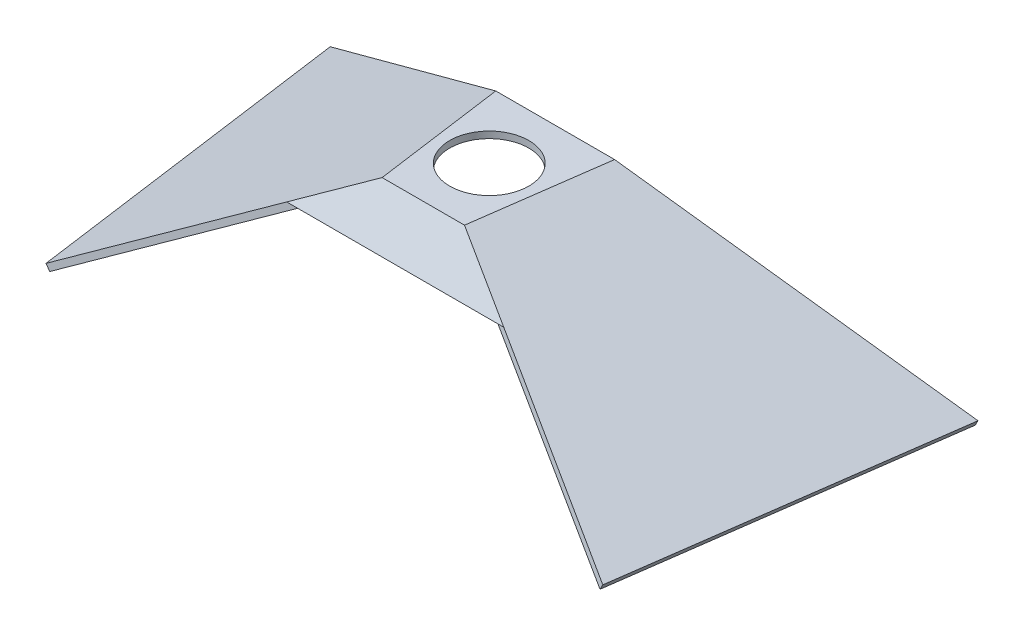
ISO-10303-21;
HEADER;
FILE_DESCRIPTION(('STEP AP214'),'2;1');
FILE_NAME('part.step','',(''),(''),'','','');
FILE_SCHEMA(('AUTOMOTIVE_DESIGN { 1 0 10303 214 1 1 1 1 }'));
ENDSEC;
DATA;
#1=APPLICATION_CONTEXT('core data for automotive mechanical design processes');
#2=APPLICATION_PROTOCOL_DEFINITION('international standard','automotive_design',2000,#1);
#3=PRODUCT_CONTEXT('',#1,'mechanical');
#4=PRODUCT('Part','Part','',(#3));
#5=PRODUCT_RELATED_PRODUCT_CATEGORY('part','',(#4));
#6=PRODUCT_DEFINITION_FORMATION('','',#4);
#7=PRODUCT_DEFINITION_CONTEXT('part definition',#1,'design');
#8=PRODUCT_DEFINITION('design','',#6,#7);
#9=PRODUCT_DEFINITION_SHAPE('','',#8);
#10=(LENGTH_UNIT() NAMED_UNIT(*) SI_UNIT(.MILLI.,.METRE.));
#11=(NAMED_UNIT(*) PLANE_ANGLE_UNIT() SI_UNIT($,.RADIAN.));
#12=(NAMED_UNIT(*) SI_UNIT($,.STERADIAN.) SOLID_ANGLE_UNIT());
#13=UNCERTAINTY_MEASURE_WITH_UNIT(LENGTH_MEASURE(1.E-05),#10,'distance_accuracy_value','');
#14=(GEOMETRIC_REPRESENTATION_CONTEXT(3) GLOBAL_UNCERTAINTY_ASSIGNED_CONTEXT((#13)) GLOBAL_UNIT_ASSIGNED_CONTEXT((#10,
#11,#12)) REPRESENTATION_CONTEXT('',''));
#15=CARTESIAN_POINT('',(0.,0.,0.));
#16=DIRECTION('',(0.,0.,1.));
#17=DIRECTION('',(1.,0.,0.));
#18=AXIS2_PLACEMENT_3D('',#15,#16,#17);
#19=CARTESIAN_POINT('',(-76.614934206943,91.7763117493343,413.028432925909));
#20=DIRECTION('',(0.55007039564233,-0.687480055635322,-0.474124174601491));
#21=DIRECTION('',(0.780820965569463,0.624754847702018,0.));
#22=AXIS2_PLACEMENT_3D('',#19,#20,#21);
#23=PLANE('',#22);
#24=DIRECTION('',(-0.835118290925238,-0.452824984693612,-0.312293088939443));
#25=VECTOR('',#24,1.);
#26=CARTESIAN_POINT('',(-76.6149342168398,94.6603951524479,408.846511964929));
#27=LINE('',#26,#25);
#28=CARTESIAN_POINT('',(-38.0525888196996,115.57,423.266928918652));
#29=VERTEX_POINT('',#28);
#30=CARTESIAN_POINT('',(-76.6149342168398,94.6603951524479,408.846511964929));
#31=VERTEX_POINT('',#30);
#32=EDGE_CURVE('E111',#29,#31,#27,.T.);
#33=ORIENTED_EDGE('',*,*,#32,.T.);
#34=DIRECTION('',(-1.94817627023507E-09,0.567732953368821,-0.823212787594505));
#35=VECTOR('',#34,1.);
#36=CARTESIAN_POINT('',(-76.614934206943,91.7763117493343,413.028432925909));
#37=LINE('',#36,#35);
#38=CARTESIAN_POINT('',(-76.614934206943,91.7763117493343,413.028432925909));
#39=VERTEX_POINT('',#38);
#40=EDGE_CURVE('E12',#39,#31,#37,.T.);
#41=ORIENTED_EDGE('',*,*,#40,.F.);
#42=DIRECTION('',(-0.835118290925238,-0.452824984693612,-0.312293088939443));
#43=VECTOR('',#42,1.);
#44=CARTESIAN_POINT('',(-76.614934206943,91.7763117493343,413.028432925909));
#45=LINE('',#44,#43);
#46=CARTESIAN_POINT('',(-38.0525888098029,112.685916596886,427.448849879632));
#47=VERTEX_POINT('',#46);
#48=EDGE_CURVE('E99',#47,#39,#45,.T.);
#49=ORIENTED_EDGE('',*,*,#48,.F.);
#50=DIRECTION('',(-1.94817627023507E-09,0.567732953368821,-0.823212787594505));
#51=VECTOR('',#50,1.);
#52=CARTESIAN_POINT('',(-38.0525888098029,112.685916596886,427.448849879632));
#53=LINE('',#52,#51);
#54=EDGE_CURVE('E107',#47,#29,#53,.T.);
#55=ORIENTED_EDGE('',*,*,#54,.T.);
#56=EDGE_LOOP('',(#33,#41,#49,#55));
#57=FACE_BOUND('',#56,.T.);
#58=ADVANCED_FACE('F48',(#57),#23,.F.);
#59=CARTESIAN_POINT('',(92.0513793433983,91.7763119358867,413.028432655408));
#60=DIRECTION('',(0.,0.823212787594505,0.567732953368821));
#61=DIRECTION('',(0.,-0.567732953368821,0.823212787594505));
#62=AXIS2_PLACEMENT_3D('',#59,#60,#61);
#63=PLANE('',#62);
#64=DIRECTION('',(1.,1.10604379270031E-09,-1.60376363106273E-09));
#65=VECTOR('',#64,1.);
#66=CARTESIAN_POINT('',(92.0513793335016,94.6603953390003,408.846511694428));
#67=LINE('',#66,#65);
#68=CARTESIAN_POINT('',(92.0513793335016,94.6603953390003,408.846511694428));
#69=VERTEX_POINT('',#68);
#70=EDGE_CURVE('E103',#31,#69,#67,.T.);
#71=ORIENTED_EDGE('',*,*,#70,.T.);
#72=DIRECTION('',(-1.94817627023507E-09,0.567732953368821,-0.823212787594505));
#73=VECTOR('',#72,1.);
#74=CARTESIAN_POINT('',(92.0513793433983,91.7763119358867,413.028432655408));
#75=LINE('',#74,#73);
#76=CARTESIAN_POINT('',(92.0513793433983,91.7763119358867,413.028432655408));
#77=VERTEX_POINT('',#76);
#78=EDGE_CURVE('E56',#77,#69,#75,.T.);
#79=ORIENTED_EDGE('',*,*,#78,.F.);
#80=DIRECTION('',(1.,1.10604379270031E-09,-1.60376363106273E-09));
#81=VECTOR('',#80,1.);
#82=CARTESIAN_POINT('',(92.0513793433983,91.7763119358867,413.028432655408));
#83=LINE('',#82,#81);
#84=EDGE_CURVE('E94',#39,#77,#83,.T.);
#85=ORIENTED_EDGE('',*,*,#84,.F.);
#86=ORIENTED_EDGE('',*,*,#40,.T.);
#87=EDGE_LOOP('',(#71,#79,#85,#86));
#88=FACE_BOUND('',#87,.T.);
#89=ADVANCED_FACE('F102',(#88),#63,.F.);
#90=CARTESIAN_POINT('',(53.4890343585591,112.685916596886,427.448849662994));
#91=DIRECTION('',(-0.55007039788641,-0.687480055635322,-0.474124171997949));
#92=DIRECTION('',(0.78082096432612,-0.624754849255953,0.));
#93=AXIS2_PLACEMENT_3D('',#90,#91,#92);
#94=PLANE('',#93);
#95=DIRECTION('',(-0.835118289447122,0.452824984693614,0.312293092892146));
#96=VECTOR('',#95,1.);
#97=CARTESIAN_POINT('',(53.4890343486624,115.57,423.266928702014));
#98=LINE('',#97,#96);
#99=CARTESIAN_POINT('',(53.4890343486624,115.57,423.266928702014));
#100=VERTEX_POINT('',#99);
#101=EDGE_CURVE('E81',#69,#100,#98,.T.);
#102=ORIENTED_EDGE('',*,*,#101,.T.);
#103=DIRECTION('',(-1.94817627023507E-09,0.567732953368821,-0.823212787594505));
#104=VECTOR('',#103,1.);
#105=CARTESIAN_POINT('',(53.4890343585591,112.685916596886,427.448849662994));
#106=LINE('',#105,#104);
#107=CARTESIAN_POINT('',(53.4890343585591,112.685916596886,427.448849662994));
#108=VERTEX_POINT('',#107);
#109=EDGE_CURVE('E104',#108,#100,#106,.T.);
#110=ORIENTED_EDGE('',*,*,#109,.F.);
#111=DIRECTION('',(-0.835118289447122,0.452824984693614,0.312293092892146));
#112=VECTOR('',#111,1.);
#113=CARTESIAN_POINT('',(53.4890343585591,112.685916596886,427.448849662994));
#114=LINE('',#113,#112);
#115=EDGE_CURVE('E97',#77,#108,#114,.T.);
#116=ORIENTED_EDGE('',*,*,#115,.F.);
#117=ORIENTED_EDGE('',*,*,#78,.T.);
#118=EDGE_LOOP('',(#102,#110,#116,#117));
#119=FACE_BOUND('',#118,.T.);
#120=ADVANCED_FACE('F105',(#119),#94,.F.);
#121=CARTESIAN_POINT('',(-38.0525888098029,112.685916596886,427.448849879632));
#122=DIRECTION('',(-1.34357008316609E-09,-0.823212787594505,-0.567732953368821));
#123=DIRECTION('',(0.,0.567732953368821,-0.823212787594505));
#124=AXIS2_PLACEMENT_3D('',#121,#122,#123);
#125=PLANE('',#124);
#126=DIRECTION('',(-1.,0.,2.36655292808633E-09));
#127=VECTOR('',#126,1.);
#128=CARTESIAN_POINT('',(-38.0525888196996,115.57,423.266928918652));
#129=LINE('',#128,#127);
#130=EDGE_CURVE('E87',#100,#29,#129,.T.);
#131=ORIENTED_EDGE('',*,*,#130,.T.);
#132=ORIENTED_EDGE('',*,*,#54,.F.);
#133=DIRECTION('',(-1.,0.,2.36655292808633E-09));
#134=VECTOR('',#133,1.);
#135=CARTESIAN_POINT('',(-38.0525888098029,112.685916596886,427.448849879632));
#136=LINE('',#135,#134);
#137=EDGE_CURVE('E64',#108,#47,#136,.T.);
#138=ORIENTED_EDGE('',*,*,#137,.F.);
#139=ORIENTED_EDGE('',*,*,#109,.T.);
#140=EDGE_LOOP('',(#131,#132,#138,#139));
#141=FACE_BOUND('',#140,.T.);
#142=ADVANCED_FACE('F118',(#141),#125,.F.);
#143=CARTESIAN_POINT('',(5.60891193099527E-07,-163.453639055823,237.007778130851));
#144=DIRECTION('',(-1.948175726451E-09,0.56773295336882,-0.823212787594506));
#145=DIRECTION('',(0.,0.823212787594506,0.56773295336882));
#146=AXIS2_PLACEMENT_3D('',#143,#144,#145);
#147=PLANE('',#146);
#148=ORIENTED_EDGE('',*,*,#48,.T.);
#149=ORIENTED_EDGE('',*,*,#84,.T.);
#150=ORIENTED_EDGE('',*,*,#115,.T.);
#151=ORIENTED_EDGE('',*,*,#137,.T.);
#152=EDGE_LOOP('',(#148,#149,#150,#151));
#153=FACE_BOUND('',#152,.T.);
#154=ADVANCED_FACE('F95',(#153),#147,.F.);
#155=CARTESIAN_POINT('',(5.50994457646733E-07,-160.569555652709,232.82585716987));
#156=DIRECTION('',(-1.948175726451E-09,0.56773295336882,-0.823212787594506));
#157=DIRECTION('',(0.,0.823212787594506,0.56773295336882));
#158=AXIS2_PLACEMENT_3D('',#155,#156,#157);
#159=PLANE('',#158);
#160=ORIENTED_EDGE('',*,*,#32,.F.);
#161=ORIENTED_EDGE('',*,*,#130,.F.);
#162=ORIENTED_EDGE('',*,*,#101,.F.);
#163=ORIENTED_EDGE('',*,*,#70,.F.);
#164=EDGE_LOOP('',(#160,#161,#162,#163));
#165=FACE_BOUND('',#164,.T.);
#166=ADVANCED_FACE('F121',(#165),#159,.T.);
#167=CLOSED_SHELL('',(#58,#89,#120,#142,#154,#166));
#168=MANIFOLD_SOLID_BREP('B2',#167);
#169=CARTESIAN_POINT('',(-24.0317770052481,112.685916573425,520.68500790749));
#170=DIRECTION('',(-0.59196428788115,0.663480028861955,-0.457572434893867));
#171=DIRECTION('',(-0.746177081818555,-0.665747521639206,0.));
#172=AXIS2_PLACEMENT_3D('',#169,#170,#171);
#173=PLANE('',#172);
#174=DIRECTION('',(-0.805964193915191,-0.487312568806148,0.336077637474126));
#175=VECTOR('',#174,1.);
#176=CARTESIAN_POINT('',(-24.0317769953513,115.57,524.86692885229));
#177=LINE('',#176,#175);
#178=CARTESIAN_POINT('',(-24.0317769953513,115.57,524.86692885229));
#179=VERTEX_POINT('',#178);
#180=CARTESIAN_POINT('',(-75.9052369604463,84.2055929713754,546.497554634795));
#181=VERTEX_POINT('',#180);
#182=EDGE_CURVE('E246',#179,#181,#177,.T.);
#183=ORIENTED_EDGE('',*,*,#182,.F.);
#184=DIRECTION('',(1.94817619940944E-09,0.567732957987197,0.823212784409419));
#185=VECTOR('',#184,1.);
#186=CARTESIAN_POINT('',(-24.0317770052481,112.685916573425,520.68500790749));
#187=LINE('',#186,#185);
#188=CARTESIAN_POINT('',(-24.0317770052481,112.685916573425,520.68500790749));
#189=VERTEX_POINT('',#188);
#190=EDGE_CURVE('E46',#189,#179,#187,.T.);
#191=ORIENTED_EDGE('',*,*,#190,.F.);
#192=DIRECTION('',(-0.805964193915191,-0.487312568806148,0.336077637474126));
#193=VECTOR('',#192,1.);
#194=CARTESIAN_POINT('',(-24.0317770052481,112.685916573425,520.68500790749));
#195=LINE('',#194,#193);
#196=CARTESIAN_POINT('',(-75.905236970343,81.3215095448004,542.315633689995));
#197=VERTEX_POINT('',#196);
#198=EDGE_CURVE('E240',#189,#197,#195,.T.);
#199=ORIENTED_EDGE('',*,*,#198,.T.);
#200=DIRECTION('',(1.94817619940944E-09,0.567732957987197,0.823212784409419));
#201=VECTOR('',#200,1.);
#202=CARTESIAN_POINT('',(-75.905236970343,81.3215095448004,542.315633689995));
#203=LINE('',#202,#201);
#204=EDGE_CURVE('E185',#197,#181,#203,.T.);
#205=ORIENTED_EDGE('',*,*,#204,.T.);
#206=EDGE_LOOP('',(#183,#191,#199,#205));
#207=FACE_BOUND('',#206,.T.);
#208=ADVANCED_FACE('F182',(#207),#173,.T.);
#209=CARTESIAN_POINT('',(39.4682229953008,112.685916573425,520.685007757214));
#210=DIRECTION('',(-1.34357021875109E-09,0.823212784409419,-0.567732957987197));
#211=DIRECTION('',(0.,0.567732957987197,0.823212784409419));
#212=AXIS2_PLACEMENT_3D('',#209,#210,#211);
#213=PLANE('',#212);
#214=DIRECTION('',(-1.,0.,2.36655314765324E-09));
#215=VECTOR('',#214,1.);
#216=CARTESIAN_POINT('',(39.4682230051976,115.57,524.866928702014));
#217=LINE('',#216,#215);
#218=CARTESIAN_POINT('',(39.4682230051976,115.57,524.866928702014));
#219=VERTEX_POINT('',#218);
#220=EDGE_CURVE('E242',#219,#179,#217,.T.);
#221=ORIENTED_EDGE('',*,*,#220,.F.);
#222=DIRECTION('',(1.94817619940944E-09,0.567732957987197,0.823212784409419));
#223=VECTOR('',#222,1.);
#224=CARTESIAN_POINT('',(39.4682229953008,112.685916573425,520.685007757214));
#225=LINE('',#224,#223);
#226=CARTESIAN_POINT('',(39.4682229953008,112.685916573425,520.685007757214));
#227=VERTEX_POINT('',#226);
#228=EDGE_CURVE('E191',#227,#219,#225,.T.);
#229=ORIENTED_EDGE('',*,*,#228,.F.);
#230=DIRECTION('',(-1.,0.,2.36655314765324E-09));
#231=VECTOR('',#230,1.);
#232=CARTESIAN_POINT('',(39.4682229953008,112.685916573425,520.685007757214));
#233=LINE('',#232,#231);
#234=EDGE_CURVE('E237',#227,#189,#233,.T.);
#235=ORIENTED_EDGE('',*,*,#234,.T.);
#236=ORIENTED_EDGE('',*,*,#190,.T.);
#237=EDGE_LOOP('',(#221,#229,#235,#236));
#238=FACE_BOUND('',#237,.T.);
#239=ADVANCED_FACE('F256',(#238),#213,.T.);
#240=CARTESIAN_POINT('',(91.3416833687175,81.321509359818,542.31563342177));
#241=DIRECTION('',(0.591964285715411,0.663480028861956,-0.457572437695696));
#242=DIRECTION('',(-0.746177083028517,0.665747520283068,0.));
#243=AXIS2_PLACEMENT_3D('',#240,#241,#242);
#244=PLANE('',#243);
#245=DIRECTION('',(-0.805964195505882,0.487312568806148,-0.336077633659413));
#246=VECTOR('',#245,1.);
#247=CARTESIAN_POINT('',(91.3416833786143,84.205592786393,546.49755436657));
#248=LINE('',#247,#246);
#249=CARTESIAN_POINT('',(91.3416833786143,84.205592786393,546.49755436657));
#250=VERTEX_POINT('',#249);
#251=EDGE_CURVE('E232',#250,#219,#248,.T.);
#252=ORIENTED_EDGE('',*,*,#251,.F.);
#253=DIRECTION('',(1.94817619940944E-09,0.567732957987197,0.823212784409419));
#254=VECTOR('',#253,1.);
#255=CARTESIAN_POINT('',(91.3416833687175,81.321509359818,542.31563342177));
#256=LINE('',#255,#254);
#257=CARTESIAN_POINT('',(91.3416833687175,81.321509359818,542.31563342177));
#258=VERTEX_POINT('',#257);
#259=EDGE_CURVE('E227',#258,#250,#256,.T.);
#260=ORIENTED_EDGE('',*,*,#259,.F.);
#261=DIRECTION('',(-0.805964195505882,0.487312568806148,-0.336077633659413));
#262=VECTOR('',#261,1.);
#263=CARTESIAN_POINT('',(91.3416833687175,81.321509359818,542.31563342177));
#264=LINE('',#263,#262);
#265=EDGE_CURVE('E230',#258,#227,#264,.T.);
#266=ORIENTED_EDGE('',*,*,#265,.T.);
#267=ORIENTED_EDGE('',*,*,#228,.T.);
#268=EDGE_LOOP('',(#252,#260,#266,#267));
#269=FACE_BOUND('',#268,.T.);
#270=ADVANCED_FACE('F229',(#269),#244,.T.);
#271=CARTESIAN_POINT('',(-75.905236970343,81.3215095448004,542.315633689995));
#272=DIRECTION('',(0.,-0.823212784409419,0.567732957987197));
#273=DIRECTION('',(0.,-0.567732957987197,-0.823212784409419));
#274=AXIS2_PLACEMENT_3D('',#271,#272,#273);
#275=PLANE('',#274);
#276=DIRECTION('',(1.,-1.10604379379311E-09,-1.60376378312466E-09));
#277=VECTOR('',#276,1.);
#278=CARTESIAN_POINT('',(-75.9052369604463,84.2055929713754,546.497554634795));
#279=LINE('',#278,#277);
#280=EDGE_CURVE('E249',#181,#250,#279,.T.);
#281=ORIENTED_EDGE('',*,*,#280,.F.);
#282=ORIENTED_EDGE('',*,*,#204,.F.);
#283=DIRECTION('',(1.,-1.10604379379311E-09,-1.60376378312466E-09));
#284=VECTOR('',#283,1.);
#285=CARTESIAN_POINT('',(-75.905236970343,81.3215095448004,542.315633689995));
#286=LINE('',#285,#284);
#287=EDGE_CURVE('E236',#197,#258,#286,.T.);
#288=ORIENTED_EDGE('',*,*,#287,.T.);
#289=ORIENTED_EDGE('',*,*,#259,.T.);
#290=EDGE_LOOP('',(#281,#282,#288,#289));
#291=FACE_BOUND('',#290,.T.);
#292=ADVANCED_FACE('F239',(#291),#275,.T.);
#293=CARTESIAN_POINT('',(9.59691144080762E-07,279.670968685341,405.522902292263));
#294=DIRECTION('',(-1.94817608305874E-09,-0.567732957987197,-0.823212784409418));
#295=DIRECTION('',(0.,0.823212784409419,-0.567732957987197));
#296=AXIS2_PLACEMENT_3D('',#293,#294,#295);
#297=PLANE('',#296);
#298=ORIENTED_EDGE('',*,*,#198,.F.);
#299=ORIENTED_EDGE('',*,*,#234,.F.);
#300=ORIENTED_EDGE('',*,*,#265,.F.);
#301=ORIENTED_EDGE('',*,*,#287,.F.);
#302=EDGE_LOOP('',(#298,#299,#300,#301));
#303=FACE_BOUND('',#302,.T.);
#304=ADVANCED_FACE('F235',(#303),#297,.T.);
#305=CARTESIAN_POINT('',(9.69587879173762E-07,282.555052111916,409.704823237062));
#306=DIRECTION('',(-1.94817608305874E-09,-0.567732957987197,-0.823212784409418));
#307=DIRECTION('',(0.,0.823212784409419,-0.567732957987197));
#308=AXIS2_PLACEMENT_3D('',#305,#306,#307);
#309=PLANE('',#308);
#310=ORIENTED_EDGE('',*,*,#182,.T.);
#311=ORIENTED_EDGE('',*,*,#280,.T.);
#312=ORIENTED_EDGE('',*,*,#251,.T.);
#313=ORIENTED_EDGE('',*,*,#220,.T.);
#314=EDGE_LOOP('',(#310,#311,#312,#313));
#315=FACE_BOUND('',#314,.T.);
#316=ADVANCED_FACE('F255',(#315),#309,.F.);
#317=CLOSED_SHELL('',(#208,#239,#270,#292,#304,#316));
#318=MANIFOLD_SOLID_BREP('B6',#317);
#319=CARTESIAN_POINT('',(-35.5370849512563,111.1702120246,422.919789091822));
#320=DIRECTION('',(0.857968930698351,0.499870781690815,-0.118399812365316));
#321=DIRECTION('',(0.503411778049508,-0.864046631682013,-2.38270078884459E-09));
#322=AXIS2_PLACEMENT_3D('',#319,#320,#321);
#323=PLANE('',#322);
#324=DIRECTION('',(0.13670455262361,0.,0.990611864098133));
#325=VECTOR('',#324,1.);
#326=CARTESIAN_POINT('',(-38.0525888196996,115.57,423.266928918652));
#327=LINE('',#326,#325);
#328=CARTESIAN_POINT('',(-38.0525888196996,115.57,423.266928918652));
#329=VERTEX_POINT('',#328);
#330=CARTESIAN_POINT('',(-24.0317769953513,115.57,524.86692885229));
#331=VERTEX_POINT('',#330);
#332=EDGE_CURVE('E380',#329,#331,#327,.T.);
#333=ORIENTED_EDGE('',*,*,#332,.T.);
#334=DIRECTION('',(-0.495177926858929,0.866099995157495,0.0683346115806571));
#335=VECTOR('',#334,1.);
#336=CARTESIAN_POINT('',(-21.516273126908,111.1702120246,524.51978902546));
#337=LINE('',#336,#335);
#338=CARTESIAN_POINT('',(-21.516273126908,111.1702120246,524.51978902546));
#339=VERTEX_POINT('',#338);
#340=EDGE_CURVE('E319',#339,#331,#337,.T.);
#341=ORIENTED_EDGE('',*,*,#340,.F.);
#342=DIRECTION('',(0.13670455262361,0.,0.990611864098133));
#343=VECTOR('',#342,1.);
#344=CARTESIAN_POINT('',(-35.5370849512563,111.1702120246,422.919789091822));
#345=LINE('',#344,#343);
#346=CARTESIAN_POINT('',(-35.5370849512563,111.1702120246,422.919789091822));
#347=VERTEX_POINT('',#346);
#348=EDGE_CURVE('E369',#347,#339,#345,.T.);
#349=ORIENTED_EDGE('',*,*,#348,.F.);
#350=DIRECTION('',(-0.495177926858929,0.866099995157495,0.0683346115806571));
#351=VECTOR('',#350,1.);
#352=CARTESIAN_POINT('',(-35.5370849512563,111.1702120246,422.919789091822));
#353=LINE('',#352,#351);
#354=EDGE_CURVE('E180',#347,#329,#353,.T.);
#355=ORIENTED_EDGE('',*,*,#354,.T.);
#356=EDGE_LOOP('',(#333,#341,#349,#355));
#357=FACE_BOUND('',#356,.T.);
#358=ADVANCED_FACE('F316',(#357),#323,.T.);
#359=CARTESIAN_POINT('',(-35.5370849512563,111.1702120246,422.919789091822));
#360=DIRECTION('',(-0.239533423375116,-0.211708128387683,0.947524884876794));
#361=DIRECTION('',(-0.969500617123409,0.,-0.245088868366824));
#362=AXIS2_PLACEMENT_3D('',#359,#360,#361);
#363=PLANE('',#362);
#364=DIRECTION('',(-0.835118290925238,-0.452824984693613,-0.312293088939444));
#365=VECTOR('',#364,1.);
#366=CARTESIAN_POINT('',(-38.0525888196996,115.57,423.266928918652));
#367=LINE('',#366,#365);
#368=CARTESIAN_POINT('',(-241.822749661779,5.07999999999997,347.066929883117));
#369=VERTEX_POINT('',#368);
#370=EDGE_CURVE('E357',#329,#369,#367,.T.);
#371=ORIENTED_EDGE('',*,*,#370,.F.);
#372=ORIENTED_EDGE('',*,*,#354,.F.);
#373=DIRECTION('',(-0.835118290925238,-0.452824984693613,-0.312293088939444));
#374=VECTOR('',#373,1.);
#375=CARTESIAN_POINT('',(-35.5370849512563,111.1702120246,422.919789091822));
#376=LINE('',#375,#374);
#377=CARTESIAN_POINT('',(-239.307245793336,0.680212024599896,346.719790056288));
#378=VERTEX_POINT('',#377);
#379=EDGE_CURVE('E334',#347,#378,#376,.T.);
#380=ORIENTED_EDGE('',*,*,#379,.T.);
#381=DIRECTION('',(-0.495177926858929,0.866099995157495,0.0683346115806571));
#382=VECTOR('',#381,1.);
#383=CARTESIAN_POINT('',(-239.307245793336,0.680212024599896,346.719790056288));
#384=LINE('',#383,#382);
#385=EDGE_CURVE('E325',#378,#369,#384,.T.);
#386=ORIENTED_EDGE('',*,*,#385,.T.);
#387=EDGE_LOOP('',(#371,#372,#380,#386));
#388=FACE_BOUND('',#387,.T.);
#389=ADVANCED_FACE('F386',(#388),#363,.F.);
#390=CARTESIAN_POINT('',(-204.255216232465,0.680212024599896,600.719789890383));
#391=DIRECTION('',(-0.857968930698351,-0.499870781690815,0.118399812365317));
#392=DIRECTION('',(-0.503411778049508,0.864046631682013,2.38270078884459E-09));
#393=AXIS2_PLACEMENT_3D('',#390,#391,#392);
#394=PLANE('',#393);
#395=DIRECTION('',(-0.13670455262361,0.,-0.990611864098133));
#396=VECTOR('',#395,1.);
#397=CARTESIAN_POINT('',(-206.770720100908,5.07999999999997,601.066929717212));
#398=LINE('',#397,#396);
#399=CARTESIAN_POINT('',(-206.770720100908,5.07999999999997,601.066929717212));
#400=VERTEX_POINT('',#399);
#401=EDGE_CURVE('E351',#400,#369,#398,.T.);
#402=ORIENTED_EDGE('',*,*,#401,.T.);
#403=ORIENTED_EDGE('',*,*,#385,.F.);
#404=DIRECTION('',(-0.13670455262361,0.,-0.990611864098133));
#405=VECTOR('',#404,1.);
#406=CARTESIAN_POINT('',(-204.255216232465,0.680212024599896,600.719789890383));
#407=LINE('',#406,#405);
#408=CARTESIAN_POINT('',(-204.255216232465,0.680212024599896,600.719789890383));
#409=VERTEX_POINT('',#408);
#410=EDGE_CURVE('E367',#409,#378,#407,.T.);
#411=ORIENTED_EDGE('',*,*,#410,.F.);
#412=DIRECTION('',(-0.495177926858929,0.866099995157495,0.0683346115806571));
#413=VECTOR('',#412,1.);
#414=CARTESIAN_POINT('',(-204.255216232465,0.680212024599896,600.719789890383));
#415=LINE('',#414,#413);
#416=EDGE_CURVE('E372',#409,#400,#415,.T.);
#417=ORIENTED_EDGE('',*,*,#416,.T.);
#418=EDGE_LOOP('',(#402,#403,#411,#417));
#419=FACE_BOUND('',#418,.T.);
#420=ADVANCED_FACE('F375',(#419),#394,.T.);
#421=CARTESIAN_POINT('',(-21.516273126908,111.1702120246,524.51978902546));
#422=DIRECTION('',(0.324377155296623,0.111342977648972,0.939352012000789));
#423=DIRECTION('',(-0.945229411479859,0.,0.326406739626252));
#424=AXIS2_PLACEMENT_3D('',#421,#422,#423);
#425=PLANE('',#424);
#426=DIRECTION('',(-0.805964193915191,-0.487312568806148,0.336077637474126));
#427=VECTOR('',#426,1.);
#428=CARTESIAN_POINT('',(-24.0317769953513,115.57,524.86692885229));
#429=LINE('',#428,#427);
#430=EDGE_CURVE('E374',#331,#400,#429,.T.);
#431=ORIENTED_EDGE('',*,*,#430,.T.);
#432=ORIENTED_EDGE('',*,*,#416,.F.);
#433=DIRECTION('',(-0.805964193915191,-0.487312568806148,0.336077637474126));
#434=VECTOR('',#433,1.);
#435=CARTESIAN_POINT('',(-21.516273126908,111.1702120246,524.51978902546));
#436=LINE('',#435,#434);
#437=EDGE_CURVE('E364',#339,#409,#436,.T.);
#438=ORIENTED_EDGE('',*,*,#437,.F.);
#439=ORIENTED_EDGE('',*,*,#340,.T.);
#440=EDGE_LOOP('',(#431,#432,#438,#439));
#441=FACE_BOUND('',#440,.T.);
#442=ADVANCED_FACE('F373',(#441),#425,.T.);
#443=CARTESIAN_POINT('',(-59.0509663763443,130.283564464585,10.2792712055983));
#444=DIRECTION('',(-0.495177926858929,0.866099995157495,0.0683346115806572));
#445=DIRECTION('',(0.868129283349809,0.496338138158399,-4.10894702597374E-09));
#446=AXIS2_PLACEMENT_3D('',#443,#444,#445);
#447=PLANE('',#446);
#448=ORIENTED_EDGE('',*,*,#348,.T.);
#449=ORIENTED_EDGE('',*,*,#437,.T.);
#450=ORIENTED_EDGE('',*,*,#410,.T.);
#451=ORIENTED_EDGE('',*,*,#379,.F.);
#452=EDGE_LOOP('',(#448,#449,#450,#451));
#453=FACE_BOUND('',#452,.T.);
#454=ADVANCED_FACE('F365',(#453),#447,.F.);
#455=CARTESIAN_POINT('',(-61.5664702447877,134.683352439985,10.6264110324281));
#456=DIRECTION('',(-0.495177926858929,0.866099995157495,0.0683346115806572));
#457=DIRECTION('',(0.868129283349809,0.496338138158399,-4.10894702597374E-09));
#458=AXIS2_PLACEMENT_3D('',#455,#456,#457);
#459=PLANE('',#458);
#460=ORIENTED_EDGE('',*,*,#332,.F.);
#461=ORIENTED_EDGE('',*,*,#370,.T.);
#462=ORIENTED_EDGE('',*,*,#401,.F.);
#463=ORIENTED_EDGE('',*,*,#430,.F.);
#464=EDGE_LOOP('',(#460,#461,#462,#463));
#465=FACE_BOUND('',#464,.T.);
#466=ADVANCED_FACE('F389',(#465),#459,.T.);
#467=CLOSED_SHELL('',(#358,#389,#420,#442,#454,#466));
#468=MANIFOLD_SOLID_BREP('B40',#467);
#469=CARTESIAN_POINT('',(50.973530478576,111.1702120246,422.91978888709));
#470=DIRECTION('',(-0.85796893125875,0.499870781690815,-0.118399808304459));
#471=DIRECTION('',(-0.503411778049508,-0.864046631682013,0.));
#472=AXIS2_PLACEMENT_3D('',#469,#470,#471);
#473=PLANE('',#472);
#474=DIRECTION('',(-0.13670454793494,0.,0.99061186474517));
#475=VECTOR('',#474,1.);
#476=CARTESIAN_POINT('',(53.4890343486624,115.57,423.266928702014));
#477=LINE('',#476,#475);
#478=CARTESIAN_POINT('',(53.4890343486624,115.57,423.266928702014));
#479=VERTEX_POINT('',#478);
#480=CARTESIAN_POINT('',(39.4682230051976,115.57,524.866928702014));
#481=VERTEX_POINT('',#480);
#482=EDGE_CURVE('E514',#479,#481,#477,.T.);
#483=ORIENTED_EDGE('',*,*,#482,.F.);
#484=DIRECTION('',(0.495177927182364,0.866099995157495,0.068334609236928));
#485=VECTOR('',#484,1.);
#486=CARTESIAN_POINT('',(50.973530478576,111.1702120246,422.91978888709));
#487=LINE('',#486,#485);
#488=CARTESIAN_POINT('',(50.973530478576,111.1702120246,422.91978888709));
#489=VERTEX_POINT('',#488);
#490=EDGE_CURVE('E314',#489,#479,#487,.T.);
#491=ORIENTED_EDGE('',*,*,#490,.F.);
#492=DIRECTION('',(-0.13670454793494,0.,0.99061186474517));
#493=VECTOR('',#492,1.);
#494=CARTESIAN_POINT('',(50.973530478576,111.1702120246,422.91978888709));
#495=LINE('',#494,#493);
#496=CARTESIAN_POINT('',(36.9527191351112,111.1702120246,524.51978888709));
#497=VERTEX_POINT('',#496);
#498=EDGE_CURVE('E508',#489,#497,#495,.T.);
#499=ORIENTED_EDGE('',*,*,#498,.T.);
#500=DIRECTION('',(0.495177927182364,0.866099995157495,0.068334609236928));
#501=VECTOR('',#500,1.);
#502=CARTESIAN_POINT('',(36.9527191351112,111.1702120246,524.51978888709));
#503=LINE('',#502,#501);
#504=EDGE_CURVE('E452',#497,#481,#503,.T.);
#505=ORIENTED_EDGE('',*,*,#504,.T.);
#506=EDGE_LOOP('',(#483,#491,#499,#505));
#507=FACE_BOUND('',#506,.T.);
#508=ADVANCED_FACE('F449',(#507),#473,.T.);
#509=CARTESIAN_POINT('',(50.973530478576,111.1702120246,422.91978888709));
#510=DIRECTION('',(0.239533427859851,-0.211708128387683,0.947524883743057));
#511=DIRECTION('',(0.969500615963377,0.,-0.245088872955572));
#512=AXIS2_PLACEMENT_3D('',#509,#510,#511);
#513=PLANE('',#512);
#514=DIRECTION('',(0.835118289447122,-0.452824984693613,-0.312293092892146));
#515=VECTOR('',#514,1.);
#516=CARTESIAN_POINT('',(53.4890343486624,115.57,423.266928702014));
#517=LINE('',#516,#515);
#518=CARTESIAN_POINT('',(257.259194830079,5.07999999999997,347.066928702014));
#519=VERTEX_POINT('',#518);
#520=EDGE_CURVE('E510',#479,#519,#517,.T.);
#521=ORIENTED_EDGE('',*,*,#520,.T.);
#522=DIRECTION('',(0.495177927182364,0.866099995157495,0.068334609236928));
#523=VECTOR('',#522,1.);
#524=CARTESIAN_POINT('',(254.743690959993,0.680212024599896,346.71978888709));
#525=LINE('',#524,#523);
#526=CARTESIAN_POINT('',(254.743690959993,0.680212024599896,346.71978888709));
#527=VERTEX_POINT('',#526);
#528=EDGE_CURVE('E458',#527,#519,#525,.T.);
#529=ORIENTED_EDGE('',*,*,#528,.F.);
#530=DIRECTION('',(0.835118289447122,-0.452824984693613,-0.312293092892146));
#531=VECTOR('',#530,1.);
#532=CARTESIAN_POINT('',(50.973530478576,111.1702120246,422.91978888709));
#533=LINE('',#532,#531);
#534=EDGE_CURVE('E505',#489,#527,#533,.T.);
#535=ORIENTED_EDGE('',*,*,#534,.F.);
#536=ORIENTED_EDGE('',*,*,#490,.T.);
#537=EDGE_LOOP('',(#521,#529,#535,#536));
#538=FACE_BOUND('',#537,.T.);
#539=ADVANCED_FACE('F521',(#538),#513,.F.);
#540=CARTESIAN_POINT('',(219.691662601331,0.680212024599896,600.71978888709));
#541=DIRECTION('',(0.85796893125875,-0.499870781690815,0.11839980830446));
#542=DIRECTION('',(0.503411778049508,0.864046631682013,0.));
#543=AXIS2_PLACEMENT_3D('',#540,#541,#542);
#544=PLANE('',#543);
#545=DIRECTION('',(0.13670454793494,0.,-0.99061186474517));
#546=VECTOR('',#545,1.);
#547=CARTESIAN_POINT('',(222.207166471417,5.07999999999997,601.066928702014));
#548=LINE('',#547,#546);
#549=CARTESIAN_POINT('',(222.207166471417,5.07999999999997,601.066928702014));
#550=VERTEX_POINT('',#549);
#551=EDGE_CURVE('E499',#550,#519,#548,.T.);
#552=ORIENTED_EDGE('',*,*,#551,.F.);
#553=DIRECTION('',(0.495177927182364,0.866099995157495,0.068334609236928));
#554=VECTOR('',#553,1.);
#555=CARTESIAN_POINT('',(219.691662601331,0.680212024599896,600.71978888709));
#556=LINE('',#555,#554);
#557=CARTESIAN_POINT('',(219.691662601331,0.680212024599896,600.71978888709));
#558=VERTEX_POINT('',#557);
#559=EDGE_CURVE('E494',#558,#550,#556,.T.);
#560=ORIENTED_EDGE('',*,*,#559,.F.);
#561=DIRECTION('',(0.13670454793494,0.,-0.99061186474517));
#562=VECTOR('',#561,1.);
#563=CARTESIAN_POINT('',(219.691662601331,0.680212024599896,600.71978888709));
#564=LINE('',#563,#562);
#565=EDGE_CURVE('E497',#558,#527,#564,.T.);
#566=ORIENTED_EDGE('',*,*,#565,.T.);
#567=ORIENTED_EDGE('',*,*,#528,.T.);
#568=EDGE_LOOP('',(#552,#560,#566,#567));
#569=FACE_BOUND('',#568,.T.);
#570=ADVANCED_FACE('F496',(#569),#544,.T.);
#571=CARTESIAN_POINT('',(36.9527191351112,111.1702120246,524.51978888709));
#572=DIRECTION('',(-0.324377150850571,0.111342977648972,0.9393520135361));
#573=DIRECTION('',(0.945229413024776,0.,0.326406735152382));
#574=AXIS2_PLACEMENT_3D('',#571,#572,#573);
#575=PLANE('',#574);
#576=DIRECTION('',(0.805964195505881,-0.487312568806148,0.336077633659413));
#577=VECTOR('',#576,1.);
#578=CARTESIAN_POINT('',(39.4682230051976,115.57,524.866928702014));
#579=LINE('',#578,#577);
#580=EDGE_CURVE('E517',#481,#550,#579,.T.);
#581=ORIENTED_EDGE('',*,*,#580,.F.);
#582=ORIENTED_EDGE('',*,*,#504,.F.);
#583=DIRECTION('',(0.805964195505881,-0.487312568806148,0.336077633659413));
#584=VECTOR('',#583,1.);
#585=CARTESIAN_POINT('',(36.9527191351112,111.1702120246,524.51978888709));
#586=LINE('',#585,#584);
#587=EDGE_CURVE('E504',#497,#558,#586,.T.);
#588=ORIENTED_EDGE('',*,*,#587,.T.);
#589=ORIENTED_EDGE('',*,*,#559,.T.);
#590=EDGE_LOOP('',(#581,#582,#588,#589));
#591=FACE_BOUND('',#590,.T.);
#592=ADVANCED_FACE('F507',(#591),#575,.T.);
#593=CARTESIAN_POINT('',(74.4874099505931,130.283564464585,10.2792708895727));
#594=DIRECTION('',(0.495177927182364,0.866099995157495,0.0683346092369281));
#595=DIRECTION('',(-0.868129283349809,0.496338138158399,0.));
#596=AXIS2_PLACEMENT_3D('',#593,#594,#595);
#597=PLANE('',#596);
#598=ORIENTED_EDGE('',*,*,#498,.F.);
#599=ORIENTED_EDGE('',*,*,#534,.T.);
#600=ORIENTED_EDGE('',*,*,#565,.F.);
#601=ORIENTED_EDGE('',*,*,#587,.F.);
#602=EDGE_LOOP('',(#598,#599,#600,#601));
#603=FACE_BOUND('',#602,.T.);
#604=ADVANCED_FACE('F503',(#603),#597,.F.);
#605=CARTESIAN_POINT('',(77.0029138206795,134.683352439985,10.6264107044963));
#606=DIRECTION('',(0.495177927182364,0.866099995157495,0.0683346092369281));
#607=DIRECTION('',(-0.868129283349809,0.496338138158399,0.));
#608=AXIS2_PLACEMENT_3D('',#605,#606,#607);
#609=PLANE('',#608);
#610=ORIENTED_EDGE('',*,*,#482,.T.);
#611=ORIENTED_EDGE('',*,*,#580,.T.);
#612=ORIENTED_EDGE('',*,*,#551,.T.);
#613=ORIENTED_EDGE('',*,*,#520,.F.);
#614=EDGE_LOOP('',(#610,#611,#612,#613));
#615=FACE_BOUND('',#614,.T.);
#616=ADVANCED_FACE('F523',(#615),#609,.T.);
#617=CLOSED_SHELL('',(#508,#539,#570,#592,#604,#616));
#618=MANIFOLD_SOLID_BREP('B174',#617);
#619=CARTESIAN_POINT('',(-2.56670503288625E-13,110.49,423.266928702014));
#620=DIRECTION('',(0.,0.,-1.));
#621=DIRECTION('',(-1.,0.,0.));
#622=AXIS2_PLACEMENT_3D('',#619,#620,#621);
#623=PLANE('',#622);
#624=DIRECTION('',(-1.,0.,0.));
#625=VECTOR('',#624,1.);
#626=CARTESIAN_POINT('',(-2.56670503288625E-13,115.57,423.266928702014));
#627=LINE('',#626,#625);
#628=CARTESIAN_POINT('',(53.4890343486624,115.57,423.266928702014));
#629=VERTEX_POINT('',#628);
#630=CARTESIAN_POINT('',(-38.052588819257,115.57,423.266928702014));
#631=VERTEX_POINT('',#630);
#632=EDGE_CURVE('E644',#629,#631,#627,.T.);
#633=ORIENTED_EDGE('',*,*,#632,.F.);
#634=DIRECTION('',(0.,1.,0.));
#635=VECTOR('',#634,1.);
#636=CARTESIAN_POINT('',(53.4890343486624,110.49,423.266928702014));
#637=LINE('',#636,#635);
#638=CARTESIAN_POINT('',(53.4890343486624,110.49,423.266928702014));
#639=VERTEX_POINT('',#638);
#640=EDGE_CURVE('E447',#639,#629,#637,.T.);
#641=ORIENTED_EDGE('',*,*,#640,.F.);
#642=DIRECTION('',(-1.,0.,0.));
#643=VECTOR('',#642,1.);
#644=CARTESIAN_POINT('',(-2.56670503288625E-13,110.49,423.266928702014));
#645=LINE('',#644,#643);
#646=CARTESIAN_POINT('',(-38.052588819257,110.49,423.266928702014));
#647=VERTEX_POINT('',#646);
#648=EDGE_CURVE('E634',#639,#647,#645,.T.);
#649=ORIENTED_EDGE('',*,*,#648,.T.);
#650=DIRECTION('',(0.,1.,0.));
#651=VECTOR('',#650,1.);
#652=CARTESIAN_POINT('',(-38.052588819257,110.49,423.266928702014));
#653=LINE('',#652,#651);
#654=EDGE_CURVE('E577',#647,#631,#653,.T.);
#655=ORIENTED_EDGE('',*,*,#654,.T.);
#656=EDGE_LOOP('',(#633,#641,#649,#655));
#657=FACE_BOUND('',#656,.T.);
#658=ADVANCED_FACE('F573',(#657),#623,.T.);
#659=CARTESIAN_POINT('',(109.808717172972,110.49,15.1536152298242));
#660=DIRECTION('',(-0.99061186474517,0.,-0.13670454793494));
#661=DIRECTION('',(-0.13670454793494,0.,0.99061186474517));
#662=AXIS2_PLACEMENT_3D('',#659,#660,#661);
#663=PLANE('',#662);
#664=DIRECTION('',(-0.13670454793494,0.,0.99061186474517));
#665=VECTOR('',#664,1.);
#666=CARTESIAN_POINT('',(109.808717172972,115.57,15.1536152298242));
#667=LINE('',#666,#665);
#668=CARTESIAN_POINT('',(39.4682230051976,115.57,524.866928702014));
#669=VERTEX_POINT('',#668);
#670=EDGE_CURVE('E650',#629,#669,#667,.T.);
#671=ORIENTED_EDGE('',*,*,#670,.T.);
#672=DIRECTION('',(0.,1.,0.));
#673=VECTOR('',#672,1.);
#674=CARTESIAN_POINT('',(39.4682230051976,110.49,524.866928702014));
#675=LINE('',#674,#673);
#676=CARTESIAN_POINT('',(39.4682230051976,110.49,524.866928702014));
#677=VERTEX_POINT('',#676);
#678=EDGE_CURVE('E583',#677,#669,#675,.T.);
#679=ORIENTED_EDGE('',*,*,#678,.F.);
#680=DIRECTION('',(-0.13670454793494,0.,0.99061186474517));
#681=VECTOR('',#680,1.);
#682=CARTESIAN_POINT('',(109.808717172972,110.49,15.1536152298242));
#683=LINE('',#682,#681);
#684=EDGE_CURVE('E627',#639,#677,#683,.T.);
#685=ORIENTED_EDGE('',*,*,#684,.F.);
#686=ORIENTED_EDGE('',*,*,#640,.T.);
#687=EDGE_LOOP('',(#671,#679,#685,#686));
#688=FACE_BOUND('',#687,.T.);
#689=ADVANCED_FACE('F652',(#688),#663,.F.);
#690=CARTESIAN_POINT('',(0.,110.49,524.866928702014));
#691=DIRECTION('',(0.,0.,-1.));
#692=DIRECTION('',(-1.,0.,0.));
#693=AXIS2_PLACEMENT_3D('',#690,#691,#692);
#694=PLANE('',#693);
#695=DIRECTION('',(-1.,0.,0.));
#696=VECTOR('',#695,1.);
#697=CARTESIAN_POINT('',(0.,115.57,524.866928702014));
#698=LINE('',#697,#696);
#699=CARTESIAN_POINT('',(-24.0317769948025,115.57,524.866928702014));
#700=VERTEX_POINT('',#699);
#701=EDGE_CURVE('E608',#669,#700,#698,.T.);
#702=ORIENTED_EDGE('',*,*,#701,.T.);
#703=DIRECTION('',(0.,1.,0.));
#704=VECTOR('',#703,1.);
#705=CARTESIAN_POINT('',(-24.0317769948025,110.49,524.866928702014));
#706=LINE('',#705,#704);
#707=CARTESIAN_POINT('',(-24.0317769948025,110.49,524.866928702014));
#708=VERTEX_POINT('',#707);
#709=EDGE_CURVE('E631',#708,#700,#706,.T.);
#710=ORIENTED_EDGE('',*,*,#709,.F.);
#711=DIRECTION('',(-1.,0.,0.));
#712=VECTOR('',#711,1.);
#713=CARTESIAN_POINT('',(0.,110.49,524.866928702014));
#714=LINE('',#713,#712);
#715=EDGE_CURVE('E622',#677,#708,#714,.T.);
#716=ORIENTED_EDGE('',*,*,#715,.F.);
#717=ORIENTED_EDGE('',*,*,#678,.T.);
#718=EDGE_LOOP('',(#702,#710,#716,#717));
#719=FACE_BOUND('',#718,.T.);
#720=ADVANCED_FACE('F632',(#719),#694,.F.);
#721=CARTESIAN_POINT('',(7.71822290669866,110.49,474.066928702014));
#722=DIRECTION('',(0.,1.,0.));
#723=DIRECTION('',(0.,0.,1.));
#724=AXIS2_PLACEMENT_3D('',#721,#722,#723);
#725=CYLINDRICAL_SURFACE('',#724,30.48);
#726=CARTESIAN_POINT('',(7.71822290669866,110.49,474.066928702014));
#727=DIRECTION('',(0.,1.,0.));
#728=DIRECTION('',(0.,0.,1.));
#729=AXIS2_PLACEMENT_3D('',#726,#727,#728);
#730=CIRCLE('',#729,30.48);
#731=CARTESIAN_POINT('',(7.71822290669866,110.49,504.546928702014));
#732=VERTEX_POINT('',#731);
#733=EDGE_CURVE('E636',#732,#732,#730,.T.);
#734=ORIENTED_EDGE('',*,*,#733,.F.);
#735=EDGE_LOOP('',(#734));
#736=FACE_BOUND('',#735,.T.);
#737=CARTESIAN_POINT('',(7.71822290669866,115.57,474.066928702014));
#738=DIRECTION('',(0.,1.,0.));
#739=DIRECTION('',(0.,0.,1.));
#740=AXIS2_PLACEMENT_3D('',#737,#738,#739);
#741=CIRCLE('',#740,30.48);
#742=CARTESIAN_POINT('',(7.71822290669866,115.57,504.546928702014));
#743=VERTEX_POINT('',#742);
#744=EDGE_CURVE('E641',#743,#743,#741,.T.);
#745=ORIENTED_EDGE('',*,*,#744,.T.);
#746=EDGE_LOOP('',(#745));
#747=FACE_BOUND('',#746,.T.);
#748=ADVANCED_FACE('F575',(#736,#747),#725,.F.);
#749=CARTESIAN_POINT('',(-94.6607518422322,110.49,13.063194771076));
#750=DIRECTION('',(-0.990611864110085,0.,0.136704552537004));
#751=DIRECTION('',(0.136704552537004,0.,0.990611864110085));
#752=AXIS2_PLACEMENT_3D('',#749,#750,#751);
#753=PLANE('',#752);
#754=DIRECTION('',(0.136704552537004,0.,0.990611864110085));
#755=VECTOR('',#754,1.);
#756=CARTESIAN_POINT('',(-94.6607518422322,115.57,13.063194771076));
#757=LINE('',#756,#755);
#758=EDGE_CURVE('E647',#631,#700,#757,.T.);
#759=ORIENTED_EDGE('',*,*,#758,.F.);
#760=ORIENTED_EDGE('',*,*,#654,.F.);
#761=DIRECTION('',(0.136704552537004,0.,0.990611864110085));
#762=VECTOR('',#761,1.);
#763=CARTESIAN_POINT('',(-94.6607518422322,110.49,13.063194771076));
#764=LINE('',#763,#762);
#765=EDGE_CURVE('E626',#647,#708,#764,.T.);
#766=ORIENTED_EDGE('',*,*,#765,.T.);
#767=ORIENTED_EDGE('',*,*,#709,.T.);
#768=EDGE_LOOP('',(#759,#760,#766,#767));
#769=FACE_BOUND('',#768,.T.);
#770=ADVANCED_FACE('F633',(#769),#753,.T.);
#771=CARTESIAN_POINT('',(0.,110.49,0.));
#772=DIRECTION('',(0.,1.,0.));
#773=DIRECTION('',(0.,0.,1.));
#774=AXIS2_PLACEMENT_3D('',#771,#772,#773);
#775=PLANE('',#774);
#776=ORIENTED_EDGE('',*,*,#733,.T.);
#777=EDGE_LOOP('',(#776));
#778=FACE_BOUND('',#777,.T.);
#779=ORIENTED_EDGE('',*,*,#648,.F.);
#780=ORIENTED_EDGE('',*,*,#684,.T.);
#781=ORIENTED_EDGE('',*,*,#715,.T.);
#782=ORIENTED_EDGE('',*,*,#765,.F.);
#783=EDGE_LOOP('',(#779,#780,#781,#782));
#784=FACE_BOUND('',#783,.T.);
#785=ADVANCED_FACE('F625',(#778,#784),#775,.F.);
#786=CARTESIAN_POINT('',(0.,115.57,0.));
#787=DIRECTION('',(0.,1.,0.));
#788=DIRECTION('',(0.,0.,1.));
#789=AXIS2_PLACEMENT_3D('',#786,#787,#788);
#790=PLANE('',#789);
#791=ORIENTED_EDGE('',*,*,#744,.F.);
#792=EDGE_LOOP('',(#791));
#793=FACE_BOUND('',#792,.T.);
#794=ORIENTED_EDGE('',*,*,#632,.T.);
#795=ORIENTED_EDGE('',*,*,#758,.T.);
#796=ORIENTED_EDGE('',*,*,#701,.F.);
#797=ORIENTED_EDGE('',*,*,#670,.F.);
#798=EDGE_LOOP('',(#794,#795,#796,#797));
#799=FACE_BOUND('',#798,.T.);
#800=ADVANCED_FACE('F653',(#793,#799),#790,.T.);
#801=CLOSED_SHELL('',(#658,#689,#720,#748,#770,#785,#800));
#802=MANIFOLD_SOLID_BREP('B308',#801);
#803=ADVANCED_BREP_SHAPE_REPRESENTATION('',(#18,#168,#318,#468,#618,#802),#14);
#804=SHAPE_DEFINITION_REPRESENTATION(#9,#803);
ENDSEC;
END-ISO-10303-21;
